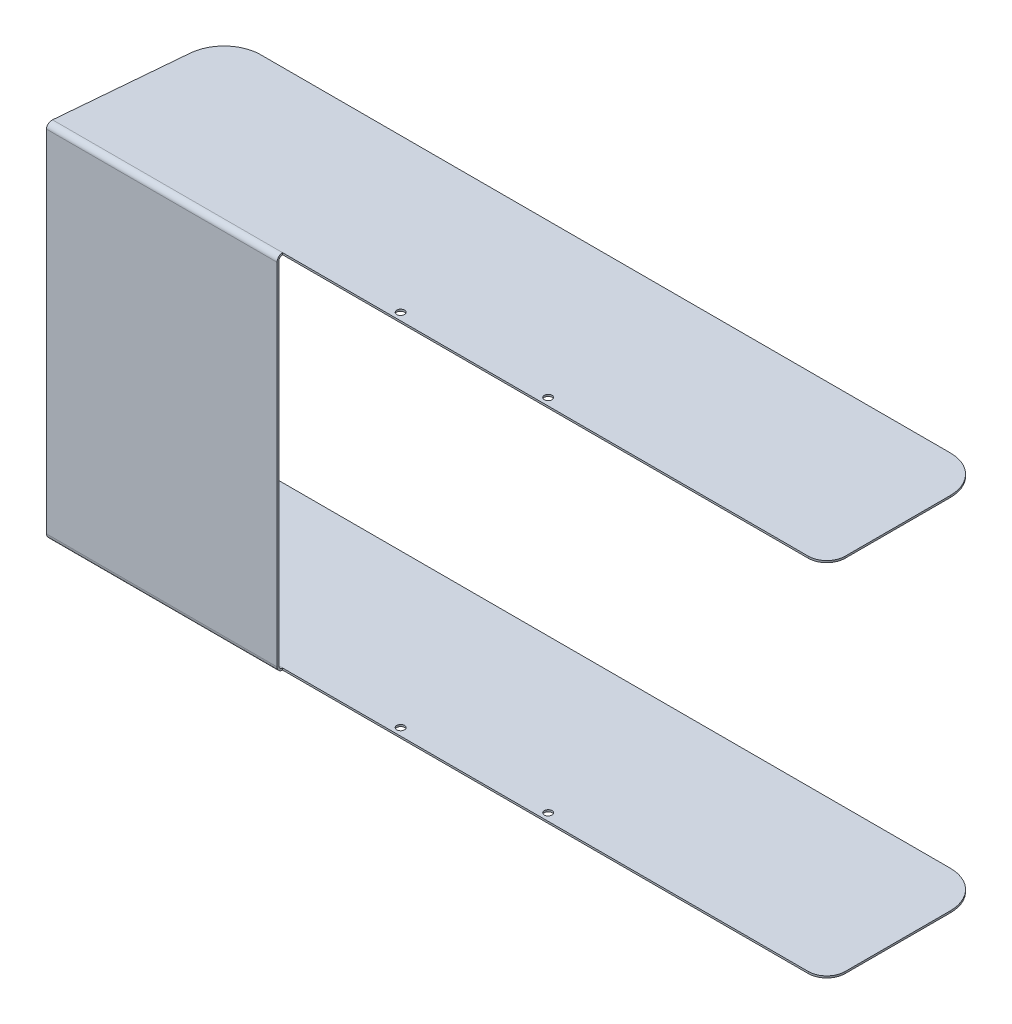
ISO-10303-21;
HEADER;
FILE_DESCRIPTION(('STEP AP214'),'2;1');
FILE_NAME('part.step','',(''),(''),'','','');
FILE_SCHEMA(('AUTOMOTIVE_DESIGN { 1 0 10303 214 1 1 1 1 }'));
ENDSEC;
DATA;
#1=APPLICATION_CONTEXT('core data for automotive mechanical design processes');
#2=APPLICATION_PROTOCOL_DEFINITION('international standard','automotive_design',2000,#1);
#3=PRODUCT_CONTEXT('',#1,'mechanical');
#4=PRODUCT('Part','Part','',(#3));
#5=PRODUCT_RELATED_PRODUCT_CATEGORY('part','',(#4));
#6=PRODUCT_DEFINITION_FORMATION('','',#4);
#7=PRODUCT_DEFINITION_CONTEXT('part definition',#1,'design');
#8=PRODUCT_DEFINITION('design','',#6,#7);
#9=PRODUCT_DEFINITION_SHAPE('','',#8);
#10=(LENGTH_UNIT() NAMED_UNIT(*) SI_UNIT(.MILLI.,.METRE.));
#11=(NAMED_UNIT(*) PLANE_ANGLE_UNIT() SI_UNIT($,.RADIAN.));
#12=(NAMED_UNIT(*) SI_UNIT($,.STERADIAN.) SOLID_ANGLE_UNIT());
#13=UNCERTAINTY_MEASURE_WITH_UNIT(LENGTH_MEASURE(1.E-05),#10,'distance_accuracy_value','');
#14=(GEOMETRIC_REPRESENTATION_CONTEXT(3) GLOBAL_UNCERTAINTY_ASSIGNED_CONTEXT((#13)) GLOBAL_UNIT_ASSIGNED_CONTEXT((#10,
#11,#12)) REPRESENTATION_CONTEXT('',''));
#15=CARTESIAN_POINT('',(0.,0.,0.));
#16=DIRECTION('',(0.,0.,1.));
#17=DIRECTION('',(1.,0.,0.));
#18=AXIS2_PLACEMENT_3D('',#15,#16,#17);
#19=CARTESIAN_POINT('',(0.,-98.,-1.));
#20=DIRECTION('',(0.,0.,1.));
#21=DIRECTION('',(0.,-1.,0.));
#22=AXIS2_PLACEMENT_3D('',#19,#20,#21);
#23=PLANE('',#22);
#24=DIRECTION('',(0.,-1.,0.));
#25=VECTOR('',#24,1.);
#26=CARTESIAN_POINT('',(0.0874886635259124,-98.,-1.));
#27=LINE('',#26,#25);
#28=CARTESIAN_POINT('',(0.0874886635259124,95.,-1.));
#29=VERTEX_POINT('',#28);
#30=CARTESIAN_POINT('',(0.0874886635259166,-95.,-1.));
#31=VERTEX_POINT('',#30);
#32=EDGE_CURVE('E320',#29,#31,#27,.T.);
#33=ORIENTED_EDGE('',*,*,#32,.F.);
#34=DIRECTION('',(-1.,0.,0.));
#35=VECTOR('',#34,1.);
#36=CARTESIAN_POINT('',(420.,95.,-1.));
#37=LINE('',#36,#35);
#38=CARTESIAN_POINT('',(125.,95.,-1.));
#39=VERTEX_POINT('',#38);
#40=EDGE_CURVE('E389',#29,#39,#37,.F.);
#41=ORIENTED_EDGE('',*,*,#40,.T.);
#42=DIRECTION('',(0.,1.,0.));
#43=VECTOR('',#42,1.);
#44=CARTESIAN_POINT('',(125.,-98.,-1.));
#45=LINE('',#44,#43);
#46=CARTESIAN_POINT('',(125.,-95.,-1.));
#47=VERTEX_POINT('',#46);
#48=EDGE_CURVE('E343',#47,#39,#45,.T.);
#49=ORIENTED_EDGE('',*,*,#48,.F.);
#50=DIRECTION('',(1.,0.,0.));
#51=VECTOR('',#50,1.);
#52=CARTESIAN_POINT('',(0.,-95.,-1.));
#53=LINE('',#52,#51);
#54=EDGE_CURVE('E392',#47,#31,#53,.F.);
#55=ORIENTED_EDGE('',*,*,#54,.T.);
#56=EDGE_LOOP('',(#33,#41,#49,#55));
#57=FACE_BOUND('',#56,.T.);
#58=ADVANCED_FACE('F15',(#57),#23,.F.);
#59=CARTESIAN_POINT('',(0.,-98.,-90.));
#60=DIRECTION('',(0.,-1.,0.));
#61=DIRECTION('',(-1.,0.,0.));
#62=AXIS2_PLACEMENT_3D('',#59,#60,#61);
#63=PLANE('',#62);
#64=CARTESIAN_POINT('',(185.,-98.,-7.));
#65=DIRECTION('',(0.,1.,0.));
#66=DIRECTION('',(-1.,0.,0.));
#67=AXIS2_PLACEMENT_3D('',#64,#65,#66);
#68=CIRCLE('',#67,2.1);
#69=CARTESIAN_POINT('',(182.9,-98.,-7.));
#70=VERTEX_POINT('',#69);
#71=EDGE_CURVE('E908',#70,#70,#68,.T.);
#72=ORIENTED_EDGE('',*,*,#71,.T.);
#73=EDGE_LOOP('',(#72));
#74=FACE_BOUND('',#73,.T.);
#75=CARTESIAN_POINT('',(265.,-98.,-7.));
#76=DIRECTION('',(0.,1.,0.));
#77=DIRECTION('',(-1.,0.,0.));
#78=AXIS2_PLACEMENT_3D('',#75,#76,#77);
#79=CIRCLE('',#78,2.1);
#80=CARTESIAN_POINT('',(262.9,-98.,-7.));
#81=VERTEX_POINT('',#80);
#82=EDGE_CURVE('E287',#81,#81,#79,.T.);
#83=ORIENTED_EDGE('',*,*,#82,.T.);
#84=EDGE_LOOP('',(#83));
#85=FACE_BOUND('',#84,.T.);
#86=DIRECTION('',(1.,0.,0.));
#87=VECTOR('',#86,1.);
#88=CARTESIAN_POINT('',(0.,-98.,-90.));
#89=LINE('',#88,#87);
#90=CARTESIAN_POINT('',(26.2006031976817,-98.,-90.));
#91=VERTEX_POINT('',#90);
#92=CARTESIAN_POINT('',(400.,-98.,-90.));
#93=VERTEX_POINT('',#92);
#94=EDGE_CURVE('E180',#91,#93,#89,.T.);
#95=ORIENTED_EDGE('',*,*,#94,.T.);
#96=CARTESIAN_POINT('',(400.,-98.,-70.));
#97=DIRECTION('',(0.,-1.,0.));
#98=DIRECTION('',(0.,0.,-1.));
#99=AXIS2_PLACEMENT_3D('',#96,#97,#98);
#100=CIRCLE('',#99,20.);
#101=CARTESIAN_POINT('',(420.,-98.,-70.));
#102=VERTEX_POINT('',#101);
#103=EDGE_CURVE('E273',#93,#102,#100,.T.);
#104=ORIENTED_EDGE('',*,*,#103,.T.);
#105=DIRECTION('',(0.,0.,1.));
#106=VECTOR('',#105,1.);
#107=CARTESIAN_POINT('',(420.,-98.,-90.));
#108=LINE('',#107,#106);
#109=CARTESIAN_POINT('',(420.,-98.,-13.));
#110=VERTEX_POINT('',#109);
#111=EDGE_CURVE('E382',#102,#110,#108,.T.);
#112=ORIENTED_EDGE('',*,*,#111,.T.);
#113=CARTESIAN_POINT('',(410.,-98.,-13.));
#114=DIRECTION('',(0.,-1.,0.));
#115=DIRECTION('',(0.,0.,-1.));
#116=AXIS2_PLACEMENT_3D('',#113,#114,#115);
#117=CIRCLE('',#116,10.);
#118=CARTESIAN_POINT('',(410.,-98.,-3.));
#119=VERTEX_POINT('',#118);
#120=EDGE_CURVE('E239',#110,#119,#117,.T.);
#121=ORIENTED_EDGE('',*,*,#120,.T.);
#122=DIRECTION('',(-1.,0.,0.));
#123=VECTOR('',#122,1.);
#124=CARTESIAN_POINT('',(0.,-98.,-3.));
#125=LINE('',#124,#123);
#126=CARTESIAN_POINT('',(125.,-98.,-3.));
#127=VERTEX_POINT('',#126);
#128=EDGE_CURVE('E358',#119,#127,#125,.T.);
#129=ORIENTED_EDGE('',*,*,#128,.T.);
#130=DIRECTION('',(1.,0.,0.));
#131=VECTOR('',#130,1.);
#132=CARTESIAN_POINT('',(0.,-98.,-3.));
#133=LINE('',#132,#131);
#134=CARTESIAN_POINT('',(0.262465990577765,-98.,-3.));
#135=VERTEX_POINT('',#134);
#136=EDGE_CURVE('E168',#127,#135,#133,.F.);
#137=ORIENTED_EDGE('',*,*,#136,.T.);
#138=DIRECTION('',(0.0871557427476582,0.,-0.996194698091746));
#139=VECTOR('',#138,1.);
#140=CARTESIAN_POINT('',(7.81416799501187,-98.,-89.3163488855494));
#141=LINE('',#140,#139);
#142=CARTESIAN_POINT('',(6.27670923584672,-98.,-71.7431148549532));
#143=VERTEX_POINT('',#142);
#144=EDGE_CURVE('E161',#135,#143,#141,.T.);
#145=ORIENTED_EDGE('',*,*,#144,.T.);
#146=CARTESIAN_POINT('',(26.2006031976817,-98.,-70.));
#147=DIRECTION('',(0.,-1.,0.));
#148=DIRECTION('',(0.,0.,-1.));
#149=AXIS2_PLACEMENT_3D('',#146,#147,#148);
#150=CIRCLE('',#149,20.);
#151=EDGE_CURVE('E226',#143,#91,#150,.T.);
#152=ORIENTED_EDGE('',*,*,#151,.T.);
#153=EDGE_LOOP('',(#95,#104,#112,#121,#129,#137,#145,#152));
#154=FACE_BOUND('',#153,.T.);
#155=ADVANCED_FACE('F481',(#74,#85,#154),#63,.T.);
#156=CARTESIAN_POINT('',(420.,98.,-90.));
#157=DIRECTION('',(0.,1.,0.));
#158=DIRECTION('',(1.,0.,0.));
#159=AXIS2_PLACEMENT_3D('',#156,#157,#158);
#160=PLANE('',#159);
#161=CARTESIAN_POINT('',(185.,98.,-7.));
#162=DIRECTION('',(0.,1.,0.));
#163=DIRECTION('',(0.,0.,1.));
#164=AXIS2_PLACEMENT_3D('',#161,#162,#163);
#165=CIRCLE('',#164,2.1);
#166=CARTESIAN_POINT('',(185.,98.,-4.9));
#167=VERTEX_POINT('',#166);
#168=EDGE_CURVE('E297',#167,#167,#165,.T.);
#169=ORIENTED_EDGE('',*,*,#168,.F.);
#170=EDGE_LOOP('',(#169));
#171=FACE_BOUND('',#170,.T.);
#172=CARTESIAN_POINT('',(265.,98.,-7.));
#173=DIRECTION('',(0.,1.,0.));
#174=DIRECTION('',(0.,0.,1.));
#175=AXIS2_PLACEMENT_3D('',#172,#173,#174);
#176=CIRCLE('',#175,2.1);
#177=CARTESIAN_POINT('',(265.,98.,-4.9));
#178=VERTEX_POINT('',#177);
#179=EDGE_CURVE('E294',#178,#178,#176,.T.);
#180=ORIENTED_EDGE('',*,*,#179,.F.);
#181=EDGE_LOOP('',(#180));
#182=FACE_BOUND('',#181,.T.);
#183=DIRECTION('',(0.,0.,1.));
#184=VECTOR('',#183,1.);
#185=CARTESIAN_POINT('',(420.,98.,-90.));
#186=LINE('',#185,#184);
#187=CARTESIAN_POINT('',(420.,98.,-70.));
#188=VERTEX_POINT('',#187);
#189=CARTESIAN_POINT('',(420.,98.,-13.));
#190=VERTEX_POINT('',#189);
#191=EDGE_CURVE('E378',#188,#190,#186,.T.);
#192=ORIENTED_EDGE('',*,*,#191,.F.);
#193=CARTESIAN_POINT('',(400.,98.,-70.));
#194=DIRECTION('',(0.,1.,0.));
#195=DIRECTION('',(0.,0.,1.));
#196=AXIS2_PLACEMENT_3D('',#193,#194,#195);
#197=CIRCLE('',#196,20.);
#198=CARTESIAN_POINT('',(400.,98.,-90.));
#199=VERTEX_POINT('',#198);
#200=EDGE_CURVE('E40',#188,#199,#197,.T.);
#201=ORIENTED_EDGE('',*,*,#200,.T.);
#202=DIRECTION('',(-1.,0.,0.));
#203=VECTOR('',#202,1.);
#204=CARTESIAN_POINT('',(420.,98.,-90.));
#205=LINE('',#204,#203);
#206=CARTESIAN_POINT('',(26.2006031976817,98.,-90.));
#207=VERTEX_POINT('',#206);
#208=EDGE_CURVE('E376',#199,#207,#205,.T.);
#209=ORIENTED_EDGE('',*,*,#208,.T.);
#210=CARTESIAN_POINT('',(26.2006031976817,98.,-70.));
#211=DIRECTION('',(0.,1.,0.));
#212=DIRECTION('',(0.,0.,1.));
#213=AXIS2_PLACEMENT_3D('',#210,#211,#212);
#214=CIRCLE('',#213,20.);
#215=CARTESIAN_POINT('',(6.27670923584686,98.,-71.7431148549532));
#216=VERTEX_POINT('',#215);
#217=EDGE_CURVE('E223',#207,#216,#214,.T.);
#218=ORIENTED_EDGE('',*,*,#217,.T.);
#219=DIRECTION('',(-0.0871557427476582,0.,0.996194698091746));
#220=VECTOR('',#219,1.);
#221=CARTESIAN_POINT('',(11.0045398624483,98.,-125.782466195605));
#222=LINE('',#221,#220);
#223=CARTESIAN_POINT('',(0.262465990577908,98.,-3.));
#224=VERTEX_POINT('',#223);
#225=EDGE_CURVE('E329',#216,#224,#222,.T.);
#226=ORIENTED_EDGE('',*,*,#225,.T.);
#227=DIRECTION('',(-1.,0.,0.));
#228=VECTOR('',#227,1.);
#229=CARTESIAN_POINT('',(420.,98.,-3.));
#230=LINE('',#229,#228);
#231=CARTESIAN_POINT('',(125.,98.,-3.));
#232=VERTEX_POINT('',#231);
#233=EDGE_CURVE('E193',#224,#232,#230,.F.);
#234=ORIENTED_EDGE('',*,*,#233,.T.);
#235=DIRECTION('',(1.,0.,0.));
#236=VECTOR('',#235,1.);
#237=CARTESIAN_POINT('',(420.,98.,-3.));
#238=LINE('',#237,#236);
#239=CARTESIAN_POINT('',(410.,98.,-3.));
#240=VERTEX_POINT('',#239);
#241=EDGE_CURVE('E351',#232,#240,#238,.T.);
#242=ORIENTED_EDGE('',*,*,#241,.T.);
#243=CARTESIAN_POINT('',(410.,98.,-13.));
#244=DIRECTION('',(0.,1.,0.));
#245=DIRECTION('',(0.,0.,1.));
#246=AXIS2_PLACEMENT_3D('',#243,#244,#245);
#247=CIRCLE('',#246,10.);
#248=EDGE_CURVE('E259',#240,#190,#247,.T.);
#249=ORIENTED_EDGE('',*,*,#248,.T.);
#250=EDGE_LOOP('',(#192,#201,#209,#218,#226,#234,#242,#249));
#251=FACE_BOUND('',#250,.T.);
#252=ADVANCED_FACE('F454',(#171,#182,#251),#160,.T.);
#253=CARTESIAN_POINT('',(0.,-95.,-3.));
#254=DIRECTION('',(-1.,0.,0.));
#255=DIRECTION('',(0.,0.,1.));
#256=AXIS2_PLACEMENT_3D('',#253,#254,#255);
#257=CYLINDRICAL_SURFACE('',#256,2.);
#258=CARTESIAN_POINT('',(0.262465990577765,-95.,-3.));
#259=DIRECTION('',(-0.996194698091746,0.,-0.0871557427476582));
#260=DIRECTION('',(-0.0871557427476582,0.,0.996194698091746));
#261=AXIS2_PLACEMENT_3D('',#258,#259,#260);
#262=ELLIPSE('',#261,2.0076396750867,2.);
#263=CARTESIAN_POINT('',(0.262465990577766,-97.,-3.));
#264=VERTEX_POINT('',#263);
#265=EDGE_CURVE('E317',#31,#264,#262,.F.);
#266=ORIENTED_EDGE('',*,*,#265,.F.);
#267=ORIENTED_EDGE('',*,*,#54,.F.);
#268=CARTESIAN_POINT('',(125.,-95.,-3.));
#269=DIRECTION('',(1.,0.,0.));
#270=DIRECTION('',(0.,0.,-1.));
#271=AXIS2_PLACEMENT_3D('',#268,#269,#270);
#272=CIRCLE('',#271,2.);
#273=CARTESIAN_POINT('',(125.,-97.,-3.));
#274=VERTEX_POINT('',#273);
#275=EDGE_CURVE('E347',#274,#47,#272,.F.);
#276=ORIENTED_EDGE('',*,*,#275,.F.);
#277=DIRECTION('',(1.,0.,0.));
#278=VECTOR('',#277,1.);
#279=CARTESIAN_POINT('',(420.,-97.,-3.));
#280=LINE('',#279,#278);
#281=EDGE_CURVE('E385',#264,#274,#280,.T.);
#282=ORIENTED_EDGE('',*,*,#281,.F.);
#283=EDGE_LOOP('',(#266,#267,#276,#282));
#284=FACE_BOUND('',#283,.T.);
#285=ADVANCED_FACE('F500',(#284),#257,.F.);
#286=CARTESIAN_POINT('',(420.,95.,-3.));
#287=DIRECTION('',(1.,0.,0.));
#288=DIRECTION('',(0.,0.,-1.));
#289=AXIS2_PLACEMENT_3D('',#286,#287,#288);
#290=CYLINDRICAL_SURFACE('',#289,2.);
#291=CARTESIAN_POINT('',(0.262465990577831,95.,-3.));
#292=DIRECTION('',(-0.996194698091746,0.,-0.0871557427476582));
#293=DIRECTION('',(0.0871557427476582,0.,-0.996194698091746));
#294=AXIS2_PLACEMENT_3D('',#291,#292,#293);
#295=ELLIPSE('',#294,2.0076396750867,2.);
#296=CARTESIAN_POINT('',(0.262465990577831,97.,-3.));
#297=VERTEX_POINT('',#296);
#298=EDGE_CURVE('E323',#297,#29,#295,.F.);
#299=ORIENTED_EDGE('',*,*,#298,.F.);
#300=DIRECTION('',(-1.,0.,0.));
#301=VECTOR('',#300,1.);
#302=CARTESIAN_POINT('',(0.,97.,-3.));
#303=LINE('',#302,#301);
#304=CARTESIAN_POINT('',(125.,97.,-3.));
#305=VERTEX_POINT('',#304);
#306=EDGE_CURVE('E395',#305,#297,#303,.T.);
#307=ORIENTED_EDGE('',*,*,#306,.F.);
#308=CARTESIAN_POINT('',(125.,95.,-3.));
#309=DIRECTION('',(1.,0.,0.));
#310=DIRECTION('',(0.,0.,-1.));
#311=AXIS2_PLACEMENT_3D('',#308,#309,#310);
#312=CIRCLE('',#311,2.);
#313=EDGE_CURVE('E187',#39,#305,#312,.F.);
#314=ORIENTED_EDGE('',*,*,#313,.F.);
#315=ORIENTED_EDGE('',*,*,#40,.F.);
#316=EDGE_LOOP('',(#299,#307,#314,#315));
#317=FACE_BOUND('',#316,.T.);
#318=ADVANCED_FACE('F409',(#317),#290,.F.);
#319=CARTESIAN_POINT('',(0.,-98.,-90.));
#320=DIRECTION('',(0.,0.,1.));
#321=DIRECTION('',(0.,-1.,0.));
#322=AXIS2_PLACEMENT_3D('',#319,#320,#321);
#323=PLANE('',#322);
#324=ORIENTED_EDGE('',*,*,#208,.F.);
#325=DIRECTION('',(0.,1.,0.));
#326=VECTOR('',#325,1.);
#327=CARTESIAN_POINT('',(400.,97.,-90.));
#328=LINE('',#327,#326);
#329=CARTESIAN_POINT('',(400.,97.,-90.));
#330=VERTEX_POINT('',#329);
#331=EDGE_CURVE('E25',#199,#330,#328,.F.);
#332=ORIENTED_EDGE('',*,*,#331,.T.);
#333=DIRECTION('',(-1.,0.,0.));
#334=VECTOR('',#333,1.);
#335=CARTESIAN_POINT('',(0.,97.,-90.));
#336=LINE('',#335,#334);
#337=CARTESIAN_POINT('',(26.2006031976817,97.,-90.));
#338=VERTEX_POINT('',#337);
#339=EDGE_CURVE('E362',#330,#338,#336,.T.);
#340=ORIENTED_EDGE('',*,*,#339,.T.);
#341=DIRECTION('',(0.,-1.,0.));
#342=VECTOR('',#341,1.);
#343=CARTESIAN_POINT('',(26.2006031976817,98.,-90.));
#344=LINE('',#343,#342);
#345=EDGE_CURVE('E219',#338,#207,#344,.F.);
#346=ORIENTED_EDGE('',*,*,#345,.T.);
#347=EDGE_LOOP('',(#324,#332,#340,#346));
#348=FACE_BOUND('',#347,.T.);
#349=ADVANCED_FACE('F467',(#348),#323,.F.);
#350=DIRECTION('',(1.,0.,0.));
#351=VECTOR('',#350,1.);
#352=CARTESIAN_POINT('',(0.,-97.,-90.));
#353=LINE('',#352,#351);
#354=CARTESIAN_POINT('',(26.2006031976817,-97.,-90.));
#355=VERTEX_POINT('',#354);
#356=CARTESIAN_POINT('',(400.,-97.,-90.));
#357=VERTEX_POINT('',#356);
#358=EDGE_CURVE('E361',#355,#357,#353,.T.);
#359=ORIENTED_EDGE('',*,*,#358,.T.);
#360=DIRECTION('',(0.,1.,0.));
#361=VECTOR('',#360,1.);
#362=CARTESIAN_POINT('',(400.,-98.,-90.));
#363=LINE('',#362,#361);
#364=EDGE_CURVE('E270',#357,#93,#363,.F.);
#365=ORIENTED_EDGE('',*,*,#364,.T.);
#366=ORIENTED_EDGE('',*,*,#94,.F.);
#367=DIRECTION('',(0.,-1.,0.));
#368=VECTOR('',#367,1.);
#369=CARTESIAN_POINT('',(26.2006031976817,-97.,-90.));
#370=LINE('',#369,#368);
#371=EDGE_CURVE('E229',#91,#355,#370,.F.);
#372=ORIENTED_EDGE('',*,*,#371,.T.);
#373=EDGE_LOOP('',(#359,#365,#366,#372));
#374=FACE_BOUND('',#373,.T.);
#375=ADVANCED_FACE('F511',(#374),#323,.F.);
#376=CARTESIAN_POINT('',(0.,-97.,-90.));
#377=DIRECTION('',(0.,-1.,0.));
#378=DIRECTION('',(-1.,0.,0.));
#379=AXIS2_PLACEMENT_3D('',#376,#377,#378);
#380=PLANE('',#379);
#381=CARTESIAN_POINT('',(185.,-97.,-7.));
#382=DIRECTION('',(0.,-1.,0.));
#383=DIRECTION('',(0.,0.,-1.));
#384=AXIS2_PLACEMENT_3D('',#381,#382,#383);
#385=CIRCLE('',#384,2.1);
#386=CARTESIAN_POINT('',(185.,-97.,-9.1));
#387=VERTEX_POINT('',#386);
#388=EDGE_CURVE('E304',#387,#387,#385,.T.);
#389=ORIENTED_EDGE('',*,*,#388,.T.);
#390=EDGE_LOOP('',(#389));
#391=FACE_BOUND('',#390,.T.);
#392=CARTESIAN_POINT('',(265.,-97.,-7.));
#393=DIRECTION('',(0.,-1.,0.));
#394=DIRECTION('',(0.,0.,-1.));
#395=AXIS2_PLACEMENT_3D('',#392,#393,#394);
#396=CIRCLE('',#395,2.1);
#397=CARTESIAN_POINT('',(265.,-97.,-9.1));
#398=VERTEX_POINT('',#397);
#399=EDGE_CURVE('E286',#398,#398,#396,.T.);
#400=ORIENTED_EDGE('',*,*,#399,.T.);
#401=EDGE_LOOP('',(#400));
#402=FACE_BOUND('',#401,.T.);
#403=DIRECTION('',(0.,0.,1.));
#404=VECTOR('',#403,1.);
#405=CARTESIAN_POINT('',(420.,-97.,-90.));
#406=LINE('',#405,#404);
#407=CARTESIAN_POINT('',(420.,-97.,-70.));
#408=VERTEX_POINT('',#407);
#409=CARTESIAN_POINT('',(420.,-97.,-13.));
#410=VERTEX_POINT('',#409);
#411=EDGE_CURVE('E181',#408,#410,#406,.T.);
#412=ORIENTED_EDGE('',*,*,#411,.F.);
#413=CARTESIAN_POINT('',(400.,-97.,-70.));
#414=DIRECTION('',(0.,-1.,0.));
#415=DIRECTION('',(0.,0.,-1.));
#416=AXIS2_PLACEMENT_3D('',#413,#414,#415);
#417=CIRCLE('',#416,20.);
#418=EDGE_CURVE('E267',#408,#357,#417,.F.);
#419=ORIENTED_EDGE('',*,*,#418,.T.);
#420=ORIENTED_EDGE('',*,*,#358,.F.);
#421=CARTESIAN_POINT('',(26.2006031976817,-97.,-70.));
#422=DIRECTION('',(0.,-1.,0.));
#423=DIRECTION('',(0.,0.,-1.));
#424=AXIS2_PLACEMENT_3D('',#421,#422,#423);
#425=CIRCLE('',#424,20.);
#426=CARTESIAN_POINT('',(6.27670923584672,-97.,-71.7431148549532));
#427=VERTEX_POINT('',#426);
#428=EDGE_CURVE('E232',#355,#427,#425,.F.);
#429=ORIENTED_EDGE('',*,*,#428,.T.);
#430=DIRECTION('',(0.0871557427476582,0.,-0.996194698091746));
#431=VECTOR('',#430,1.);
#432=CARTESIAN_POINT('',(7.81416799501187,-97.,-89.3163488855494));
#433=LINE('',#432,#431);
#434=EDGE_CURVE('E313',#264,#427,#433,.T.);
#435=ORIENTED_EDGE('',*,*,#434,.F.);
#436=ORIENTED_EDGE('',*,*,#281,.T.);
#437=DIRECTION('',(-1.,0.,0.));
#438=VECTOR('',#437,1.);
#439=CARTESIAN_POINT('',(0.,-97.,-3.));
#440=LINE('',#439,#438);
#441=CARTESIAN_POINT('',(410.,-97.,-3.));
#442=VERTEX_POINT('',#441);
#443=EDGE_CURVE('E355',#442,#274,#440,.T.);
#444=ORIENTED_EDGE('',*,*,#443,.F.);
#445=CARTESIAN_POINT('',(410.,-97.,-13.));
#446=DIRECTION('',(0.,-1.,0.));
#447=DIRECTION('',(0.,0.,-1.));
#448=AXIS2_PLACEMENT_3D('',#445,#446,#447);
#449=CIRCLE('',#448,10.);
#450=EDGE_CURVE('E245',#442,#410,#449,.F.);
#451=ORIENTED_EDGE('',*,*,#450,.T.);
#452=EDGE_LOOP('',(#412,#419,#420,#429,#435,#436,#444,#451));
#453=FACE_BOUND('',#452,.T.);
#454=ADVANCED_FACE('F493',(#391,#402,#453),#380,.F.);
#455=CARTESIAN_POINT('',(420.,97.,-90.));
#456=DIRECTION('',(0.,1.,0.));
#457=DIRECTION('',(1.,0.,0.));
#458=AXIS2_PLACEMENT_3D('',#455,#456,#457);
#459=PLANE('',#458);
#460=CARTESIAN_POINT('',(185.,97.,-7.));
#461=DIRECTION('',(0.,1.,0.));
#462=DIRECTION('',(0.,0.,1.));
#463=AXIS2_PLACEMENT_3D('',#460,#461,#462);
#464=CIRCLE('',#463,2.1);
#465=CARTESIAN_POINT('',(185.,97.,-4.9));
#466=VERTEX_POINT('',#465);
#467=EDGE_CURVE('E19',#466,#466,#464,.T.);
#468=ORIENTED_EDGE('',*,*,#467,.T.);
#469=EDGE_LOOP('',(#468));
#470=FACE_BOUND('',#469,.T.);
#471=CARTESIAN_POINT('',(265.,97.,-7.));
#472=DIRECTION('',(0.,1.,0.));
#473=DIRECTION('',(0.,0.,1.));
#474=AXIS2_PLACEMENT_3D('',#471,#472,#473);
#475=CIRCLE('',#474,2.1);
#476=CARTESIAN_POINT('',(265.,97.,-4.9));
#477=VERTEX_POINT('',#476);
#478=EDGE_CURVE('E283',#477,#477,#475,.T.);
#479=ORIENTED_EDGE('',*,*,#478,.T.);
#480=EDGE_LOOP('',(#479));
#481=FACE_BOUND('',#480,.T.);
#482=ORIENTED_EDGE('',*,*,#339,.F.);
#483=CARTESIAN_POINT('',(400.,97.,-70.));
#484=DIRECTION('',(0.,1.,0.));
#485=DIRECTION('',(0.,0.,1.));
#486=AXIS2_PLACEMENT_3D('',#483,#484,#485);
#487=CIRCLE('',#486,20.);
#488=CARTESIAN_POINT('',(420.,97.,-70.));
#489=VERTEX_POINT('',#488);
#490=EDGE_CURVE('E10',#330,#489,#487,.F.);
#491=ORIENTED_EDGE('',*,*,#490,.T.);
#492=DIRECTION('',(0.,0.,1.));
#493=VECTOR('',#492,1.);
#494=CARTESIAN_POINT('',(420.,97.,-90.));
#495=LINE('',#494,#493);
#496=CARTESIAN_POINT('',(420.,97.,-13.));
#497=VERTEX_POINT('',#496);
#498=EDGE_CURVE('E365',#489,#497,#495,.T.);
#499=ORIENTED_EDGE('',*,*,#498,.T.);
#500=CARTESIAN_POINT('',(410.,97.,-13.));
#501=DIRECTION('',(0.,1.,0.));
#502=DIRECTION('',(0.,0.,1.));
#503=AXIS2_PLACEMENT_3D('',#500,#501,#502);
#504=CIRCLE('',#503,10.);
#505=CARTESIAN_POINT('',(410.,97.,-3.));
#506=VERTEX_POINT('',#505);
#507=EDGE_CURVE('E253',#497,#506,#504,.F.);
#508=ORIENTED_EDGE('',*,*,#507,.T.);
#509=EDGE_CURVE('E196',#506,#305,#303,.T.);
#510=ORIENTED_EDGE('',*,*,#509,.T.);
#511=ORIENTED_EDGE('',*,*,#306,.T.);
#512=DIRECTION('',(-0.0871557427476582,0.,0.996194698091746));
#513=VECTOR('',#512,1.);
#514=CARTESIAN_POINT('',(11.0045398624483,97.,-125.782466195605));
#515=LINE('',#514,#513);
#516=CARTESIAN_POINT('',(6.27670923584686,97.,-71.7431148549532));
#517=VERTEX_POINT('',#516);
#518=EDGE_CURVE('E326',#517,#297,#515,.T.);
#519=ORIENTED_EDGE('',*,*,#518,.F.);
#520=CARTESIAN_POINT('',(26.2006031976817,97.,-70.));
#521=DIRECTION('',(0.,1.,0.));
#522=DIRECTION('',(0.,0.,1.));
#523=AXIS2_PLACEMENT_3D('',#520,#521,#522);
#524=CIRCLE('',#523,20.);
#525=EDGE_CURVE('E215',#517,#338,#524,.F.);
#526=ORIENTED_EDGE('',*,*,#525,.T.);
#527=EDGE_LOOP('',(#482,#491,#499,#508,#510,#511,#519,#526));
#528=FACE_BOUND('',#527,.T.);
#529=ADVANCED_FACE('F405',(#470,#481,#528),#459,.F.);
#530=CARTESIAN_POINT('',(0.,95.,-3.));
#531=DIRECTION('',(-1.,0.,0.));
#532=DIRECTION('',(0.,0.,1.));
#533=AXIS2_PLACEMENT_3D('',#530,#531,#532);
#534=CYLINDRICAL_SURFACE('',#533,3.);
#535=ORIENTED_EDGE('',*,*,#233,.F.);
#536=CARTESIAN_POINT('',(0.262465990577765,95.,-3.));
#537=DIRECTION('',(-0.996194698091746,0.,-0.0871557427476582));
#538=DIRECTION('',(-0.0871557427476582,0.,0.996194698091746));
#539=AXIS2_PLACEMENT_3D('',#536,#537,#538);
#540=ELLIPSE('',#539,3.01145951263004,3.);
#541=CARTESIAN_POINT('',(0.,95.,0.));
#542=VERTEX_POINT('',#541);
#543=EDGE_CURVE('E332',#224,#542,#540,.F.);
#544=ORIENTED_EDGE('',*,*,#543,.T.);
#545=DIRECTION('',(-1.,0.,0.));
#546=VECTOR('',#545,1.);
#547=CARTESIAN_POINT('',(0.,95.,0.));
#548=LINE('',#547,#546);
#549=CARTESIAN_POINT('',(125.,95.,0.));
#550=VERTEX_POINT('',#549);
#551=EDGE_CURVE('E178',#550,#542,#548,.T.);
#552=ORIENTED_EDGE('',*,*,#551,.F.);
#553=CARTESIAN_POINT('',(125.,95.,-3.));
#554=DIRECTION('',(1.,0.,0.));
#555=DIRECTION('',(0.,0.,-1.));
#556=AXIS2_PLACEMENT_3D('',#553,#554,#555);
#557=CIRCLE('',#556,3.);
#558=EDGE_CURVE('E204',#232,#550,#557,.T.);
#559=ORIENTED_EDGE('',*,*,#558,.F.);
#560=EDGE_LOOP('',(#535,#544,#552,#559));
#561=FACE_BOUND('',#560,.T.);
#562=ADVANCED_FACE('F473',(#561),#534,.T.);
#563=CARTESIAN_POINT('',(0.,-95.,-3.));
#564=DIRECTION('',(1.,0.,0.));
#565=DIRECTION('',(0.,0.,-1.));
#566=AXIS2_PLACEMENT_3D('',#563,#564,#565);
#567=CYLINDRICAL_SURFACE('',#566,3.);
#568=DIRECTION('',(1.,0.,0.));
#569=VECTOR('',#568,1.);
#570=CARTESIAN_POINT('',(0.,-95.,0.));
#571=LINE('',#570,#569);
#572=CARTESIAN_POINT('',(0.,-95.,0.));
#573=VERTEX_POINT('',#572);
#574=CARTESIAN_POINT('',(125.,-95.,0.));
#575=VERTEX_POINT('',#574);
#576=EDGE_CURVE('E175',#573,#575,#571,.T.);
#577=ORIENTED_EDGE('',*,*,#576,.F.);
#578=CARTESIAN_POINT('',(0.262465990577765,-95.,-3.));
#579=DIRECTION('',(-0.996194698091746,0.,-0.0871557427476582));
#580=DIRECTION('',(0.0871557427476582,0.,-0.996194698091746));
#581=AXIS2_PLACEMENT_3D('',#578,#579,#580);
#582=ELLIPSE('',#581,3.01145951263004,3.);
#583=EDGE_CURVE('E152',#573,#135,#582,.F.);
#584=ORIENTED_EDGE('',*,*,#583,.T.);
#585=ORIENTED_EDGE('',*,*,#136,.F.);
#586=CARTESIAN_POINT('',(125.,-95.,-3.));
#587=DIRECTION('',(1.,0.,0.));
#588=DIRECTION('',(0.,0.,-1.));
#589=AXIS2_PLACEMENT_3D('',#586,#587,#588);
#590=CIRCLE('',#589,3.);
#591=EDGE_CURVE('E185',#575,#127,#590,.T.);
#592=ORIENTED_EDGE('',*,*,#591,.F.);
#593=EDGE_LOOP('',(#577,#584,#585,#592));
#594=FACE_BOUND('',#593,.T.);
#595=ADVANCED_FACE('F183',(#594),#567,.T.);
#596=CARTESIAN_POINT('',(497.5,464.558539578741,-3.));
#597=DIRECTION('',(0.,0.,1.));
#598=DIRECTION('',(-1.,0.,0.));
#599=AXIS2_PLACEMENT_3D('',#596,#597,#598);
#600=PLANE('',#599);
#601=ORIENTED_EDGE('',*,*,#128,.F.);
#602=DIRECTION('',(0.,-1.,0.));
#603=VECTOR('',#602,1.);
#604=CARTESIAN_POINT('',(410.,464.558539578741,-3.));
#605=LINE('',#604,#603);
#606=EDGE_CURVE('E242',#119,#442,#605,.F.);
#607=ORIENTED_EDGE('',*,*,#606,.T.);
#608=ORIENTED_EDGE('',*,*,#443,.T.);
#609=DIRECTION('',(0.,-1.,0.));
#610=VECTOR('',#609,1.);
#611=CARTESIAN_POINT('',(125.,464.558539578741,-3.));
#612=LINE('',#611,#610);
#613=EDGE_CURVE('E338',#274,#127,#612,.T.);
#614=ORIENTED_EDGE('',*,*,#613,.T.);
#615=EDGE_LOOP('',(#601,#607,#608,#614));
#616=FACE_BOUND('',#615,.T.);
#617=ADVANCED_FACE('F477',(#616),#600,.T.);
#618=CARTESIAN_POINT('',(125.,464.558539578741,-3.));
#619=DIRECTION('',(1.,0.,0.));
#620=DIRECTION('',(0.,0.,1.));
#621=AXIS2_PLACEMENT_3D('',#618,#619,#620);
#622=PLANE('',#621);
#623=EDGE_CURVE('E342',#232,#305,#612,.T.);
#624=ORIENTED_EDGE('',*,*,#623,.F.);
#625=ORIENTED_EDGE('',*,*,#558,.T.);
#626=DIRECTION('',(0.,-1.,0.));
#627=VECTOR('',#626,1.);
#628=CARTESIAN_POINT('',(125.,464.558539578741,0.));
#629=LINE('',#628,#627);
#630=EDGE_CURVE('E335',#550,#575,#629,.T.);
#631=ORIENTED_EDGE('',*,*,#630,.T.);
#632=ORIENTED_EDGE('',*,*,#591,.T.);
#633=ORIENTED_EDGE('',*,*,#613,.F.);
#634=ORIENTED_EDGE('',*,*,#275,.T.);
#635=ORIENTED_EDGE('',*,*,#48,.T.);
#636=ORIENTED_EDGE('',*,*,#313,.T.);
#637=EDGE_LOOP('',(#624,#625,#631,#632,#633,#634,#635,#636));
#638=FACE_BOUND('',#637,.T.);
#639=ADVANCED_FACE('F414',(#638),#622,.T.);
#640=ORIENTED_EDGE('',*,*,#509,.F.);
#641=DIRECTION('',(0.,-1.,0.));
#642=VECTOR('',#641,1.);
#643=CARTESIAN_POINT('',(410.,464.558539578741,-3.));
#644=LINE('',#643,#642);
#645=EDGE_CURVE('E256',#506,#240,#644,.F.);
#646=ORIENTED_EDGE('',*,*,#645,.T.);
#647=ORIENTED_EDGE('',*,*,#241,.F.);
#648=ORIENTED_EDGE('',*,*,#623,.T.);
#649=EDGE_LOOP('',(#640,#646,#647,#648));
#650=FACE_BOUND('',#649,.T.);
#651=ADVANCED_FACE('F418',(#650),#600,.T.);
#652=CARTESIAN_POINT('',(420.,-98.,-90.));
#653=DIRECTION('',(1.,0.,0.));
#654=DIRECTION('',(0.,-1.,0.));
#655=AXIS2_PLACEMENT_3D('',#652,#653,#654);
#656=PLANE('',#655);
#657=ORIENTED_EDGE('',*,*,#111,.F.);
#658=DIRECTION('',(0.,1.,0.));
#659=VECTOR('',#658,1.);
#660=CARTESIAN_POINT('',(420.,-97.,-70.));
#661=LINE('',#660,#659);
#662=EDGE_CURVE('E263',#102,#408,#661,.T.);
#663=ORIENTED_EDGE('',*,*,#662,.T.);
#664=ORIENTED_EDGE('',*,*,#411,.T.);
#665=DIRECTION('',(0.,-1.,0.));
#666=VECTOR('',#665,1.);
#667=CARTESIAN_POINT('',(420.,-98.,-13.));
#668=LINE('',#667,#666);
#669=EDGE_CURVE('E235',#410,#110,#668,.T.);
#670=ORIENTED_EDGE('',*,*,#669,.T.);
#671=EDGE_LOOP('',(#657,#663,#664,#670));
#672=FACE_BOUND('',#671,.T.);
#673=ADVANCED_FACE('F489',(#672),#656,.T.);
#674=ORIENTED_EDGE('',*,*,#498,.F.);
#675=DIRECTION('',(0.,1.,0.));
#676=VECTOR('',#675,1.);
#677=CARTESIAN_POINT('',(420.,98.,-70.));
#678=LINE('',#677,#676);
#679=EDGE_CURVE('E276',#489,#188,#678,.T.);
#680=ORIENTED_EDGE('',*,*,#679,.T.);
#681=ORIENTED_EDGE('',*,*,#191,.T.);
#682=DIRECTION('',(0.,-1.,0.));
#683=VECTOR('',#682,1.);
#684=CARTESIAN_POINT('',(420.,-98.,-13.));
#685=LINE('',#684,#683);
#686=EDGE_CURVE('E249',#190,#497,#685,.T.);
#687=ORIENTED_EDGE('',*,*,#686,.T.);
#688=EDGE_LOOP('',(#674,#680,#681,#687));
#689=FACE_BOUND('',#688,.T.);
#690=ADVANCED_FACE('F462',(#689),#656,.T.);
#691=CARTESIAN_POINT('',(0.,-98.,0.));
#692=DIRECTION('',(0.,0.,1.));
#693=DIRECTION('',(0.,-1.,0.));
#694=AXIS2_PLACEMENT_3D('',#691,#692,#693);
#695=PLANE('',#694);
#696=ORIENTED_EDGE('',*,*,#630,.F.);
#697=ORIENTED_EDGE('',*,*,#551,.T.);
#698=DIRECTION('',(0.,-1.,0.));
#699=VECTOR('',#698,1.);
#700=CARTESIAN_POINT('',(0.,98.,0.));
#701=LINE('',#700,#699);
#702=EDGE_CURVE('E157',#542,#573,#701,.T.);
#703=ORIENTED_EDGE('',*,*,#702,.T.);
#704=ORIENTED_EDGE('',*,*,#576,.T.);
#705=EDGE_LOOP('',(#696,#697,#703,#704));
#706=FACE_BOUND('',#705,.T.);
#707=ADVANCED_FACE('F174',(#706),#695,.T.);
#708=CARTESIAN_POINT('',(-85.512741354092,356.294554754723,977.415106229773));
#709=DIRECTION('',(-0.996194698091746,0.,-0.0871557427476582));
#710=DIRECTION('',(0.0871557427476582,0.,-0.996194698091746));
#711=AXIS2_PLACEMENT_3D('',#708,#709,#710);
#712=PLANE('',#711);
#713=ORIENTED_EDGE('',*,*,#225,.F.);
#714=DIRECTION('',(0.,-1.,0.));
#715=VECTOR('',#714,1.);
#716=CARTESIAN_POINT('',(6.27670923584671,97.,-71.7431148549532));
#717=LINE('',#716,#715);
#718=EDGE_CURVE('E211',#216,#517,#717,.T.);
#719=ORIENTED_EDGE('',*,*,#718,.T.);
#720=ORIENTED_EDGE('',*,*,#518,.T.);
#721=ORIENTED_EDGE('',*,*,#298,.T.);
#722=ORIENTED_EDGE('',*,*,#32,.T.);
#723=ORIENTED_EDGE('',*,*,#265,.T.);
#724=ORIENTED_EDGE('',*,*,#434,.T.);
#725=DIRECTION('',(0.,-1.,0.));
#726=VECTOR('',#725,1.);
#727=CARTESIAN_POINT('',(6.27670923584671,-98.,-71.7431148549532));
#728=LINE('',#727,#726);
#729=EDGE_CURVE('E167',#427,#143,#728,.T.);
#730=ORIENTED_EDGE('',*,*,#729,.T.);
#731=ORIENTED_EDGE('',*,*,#144,.F.);
#732=ORIENTED_EDGE('',*,*,#583,.F.);
#733=ORIENTED_EDGE('',*,*,#702,.F.);
#734=ORIENTED_EDGE('',*,*,#543,.F.);
#735=EDGE_LOOP('',(#713,#719,#720,#721,#722,#723,#724,#730,#731,#732,#733,#734));
#736=FACE_BOUND('',#735,.T.);
#737=ADVANCED_FACE('F155',(#736),#712,.T.);
#738=CARTESIAN_POINT('',(26.2006031976817,356.294554754723,-70.));
#739=DIRECTION('',(0.,1.,0.));
#740=DIRECTION('',(0.,0.,1.));
#741=AXIS2_PLACEMENT_3D('',#738,#739,#740);
#742=CYLINDRICAL_SURFACE('',#741,20.);
#743=ORIENTED_EDGE('',*,*,#217,.F.);
#744=ORIENTED_EDGE('',*,*,#345,.F.);
#745=ORIENTED_EDGE('',*,*,#525,.F.);
#746=ORIENTED_EDGE('',*,*,#718,.F.);
#747=EDGE_LOOP('',(#743,#744,#745,#746));
#748=FACE_BOUND('',#747,.T.);
#749=ADVANCED_FACE('F471',(#748),#742,.T.);
#750=CARTESIAN_POINT('',(26.2006031976817,356.294554754723,-70.));
#751=DIRECTION('',(0.,1.,0.));
#752=DIRECTION('',(0.,0.,1.));
#753=AXIS2_PLACEMENT_3D('',#750,#751,#752);
#754=CYLINDRICAL_SURFACE('',#753,20.);
#755=ORIENTED_EDGE('',*,*,#428,.F.);
#756=ORIENTED_EDGE('',*,*,#371,.F.);
#757=ORIENTED_EDGE('',*,*,#151,.F.);
#758=ORIENTED_EDGE('',*,*,#729,.F.);
#759=EDGE_LOOP('',(#755,#756,#757,#758));
#760=FACE_BOUND('',#759,.T.);
#761=ADVANCED_FACE('F506',(#760),#754,.T.);
#762=CARTESIAN_POINT('',(410.,-98.,-13.));
#763=DIRECTION('',(0.,-1.,0.));
#764=DIRECTION('',(0.,0.,-1.));
#765=AXIS2_PLACEMENT_3D('',#762,#763,#764);
#766=CYLINDRICAL_SURFACE('',#765,10.);
#767=ORIENTED_EDGE('',*,*,#450,.F.);
#768=ORIENTED_EDGE('',*,*,#606,.F.);
#769=ORIENTED_EDGE('',*,*,#120,.F.);
#770=ORIENTED_EDGE('',*,*,#669,.F.);
#771=EDGE_LOOP('',(#767,#768,#769,#770));
#772=FACE_BOUND('',#771,.T.);
#773=ADVANCED_FACE('F487',(#772),#766,.T.);
#774=CARTESIAN_POINT('',(410.,-98.,-13.));
#775=DIRECTION('',(0.,-1.,0.));
#776=DIRECTION('',(0.,0.,-1.));
#777=AXIS2_PLACEMENT_3D('',#774,#775,#776);
#778=CYLINDRICAL_SURFACE('',#777,10.);
#779=ORIENTED_EDGE('',*,*,#248,.F.);
#780=ORIENTED_EDGE('',*,*,#645,.F.);
#781=ORIENTED_EDGE('',*,*,#507,.F.);
#782=ORIENTED_EDGE('',*,*,#686,.F.);
#783=EDGE_LOOP('',(#779,#780,#781,#782));
#784=FACE_BOUND('',#783,.T.);
#785=ADVANCED_FACE('F458',(#784),#778,.T.);
#786=CARTESIAN_POINT('',(400.,-98.,-70.));
#787=DIRECTION('',(0.,-1.,0.));
#788=DIRECTION('',(0.,0.,-1.));
#789=AXIS2_PLACEMENT_3D('',#786,#787,#788);
#790=CYLINDRICAL_SURFACE('',#789,20.);
#791=ORIENTED_EDGE('',*,*,#103,.F.);
#792=ORIENTED_EDGE('',*,*,#364,.F.);
#793=ORIENTED_EDGE('',*,*,#418,.F.);
#794=ORIENTED_EDGE('',*,*,#662,.F.);
#795=EDGE_LOOP('',(#791,#792,#793,#794));
#796=FACE_BOUND('',#795,.T.);
#797=ADVANCED_FACE('F515',(#796),#790,.T.);
#798=CARTESIAN_POINT('',(400.,-98.,-70.));
#799=DIRECTION('',(0.,-1.,0.));
#800=DIRECTION('',(0.,0.,-1.));
#801=AXIS2_PLACEMENT_3D('',#798,#799,#800);
#802=CYLINDRICAL_SURFACE('',#801,20.);
#803=ORIENTED_EDGE('',*,*,#490,.F.);
#804=ORIENTED_EDGE('',*,*,#331,.F.);
#805=ORIENTED_EDGE('',*,*,#200,.F.);
#806=ORIENTED_EDGE('',*,*,#679,.F.);
#807=EDGE_LOOP('',(#803,#804,#805,#806));
#808=FACE_BOUND('',#807,.T.);
#809=ADVANCED_FACE('F17',(#808),#802,.T.);
#810=CARTESIAN_POINT('',(265.,100.1,-7.));
#811=DIRECTION('',(0.,-1.,0.));
#812=DIRECTION('',(-1.,0.,0.));
#813=AXIS2_PLACEMENT_3D('',#810,#811,#812);
#814=CYLINDRICAL_SURFACE('',#813,2.1);
#815=ORIENTED_EDGE('',*,*,#179,.T.);
#816=EDGE_LOOP('',(#815));
#817=FACE_BOUND('',#816,.T.);
#818=ORIENTED_EDGE('',*,*,#478,.F.);
#819=EDGE_LOOP('',(#818));
#820=FACE_BOUND('',#819,.T.);
#821=ADVANCED_FACE('F521',(#817,#820),#814,.F.);
#822=ORIENTED_EDGE('',*,*,#82,.F.);
#823=EDGE_LOOP('',(#822));
#824=FACE_BOUND('',#823,.T.);
#825=ORIENTED_EDGE('',*,*,#399,.F.);
#826=EDGE_LOOP('',(#825));
#827=FACE_BOUND('',#826,.T.);
#828=ADVANCED_FACE('F587',(#824,#827),#814,.F.);
#829=CARTESIAN_POINT('',(185.,100.1,-7.));
#830=DIRECTION('',(0.,-1.,0.));
#831=DIRECTION('',(-1.,0.,0.));
#832=AXIS2_PLACEMENT_3D('',#829,#830,#831);
#833=CYLINDRICAL_SURFACE('',#832,2.1);
#834=ORIENTED_EDGE('',*,*,#168,.T.);
#835=EDGE_LOOP('',(#834));
#836=FACE_BOUND('',#835,.T.);
#837=ORIENTED_EDGE('',*,*,#467,.F.);
#838=EDGE_LOOP('',(#837));
#839=FACE_BOUND('',#838,.T.);
#840=ADVANCED_FACE('F597',(#836,#839),#833,.F.);
#841=ORIENTED_EDGE('',*,*,#71,.F.);
#842=EDGE_LOOP('',(#841));
#843=FACE_BOUND('',#842,.T.);
#844=ORIENTED_EDGE('',*,*,#388,.F.);
#845=EDGE_LOOP('',(#844));
#846=FACE_BOUND('',#845,.T.);
#847=ADVANCED_FACE('F606',(#843,#846),#833,.F.);
#848=CLOSED_SHELL('',(#58,#155,#252,#285,#318,#349,#375,#454,#529,#562,#595,#617,#639,#651,#673,
#690,#707,#737,#749,#761,#773,#785,#797,#809,#821,#828,#840,#847));
#849=MANIFOLD_SOLID_BREP('B1',#848);
#850=ADVANCED_BREP_SHAPE_REPRESENTATION('',(#18,#849),#14);
#851=SHAPE_DEFINITION_REPRESENTATION(#9,#850);
ENDSEC;
END-ISO-10303-21;
